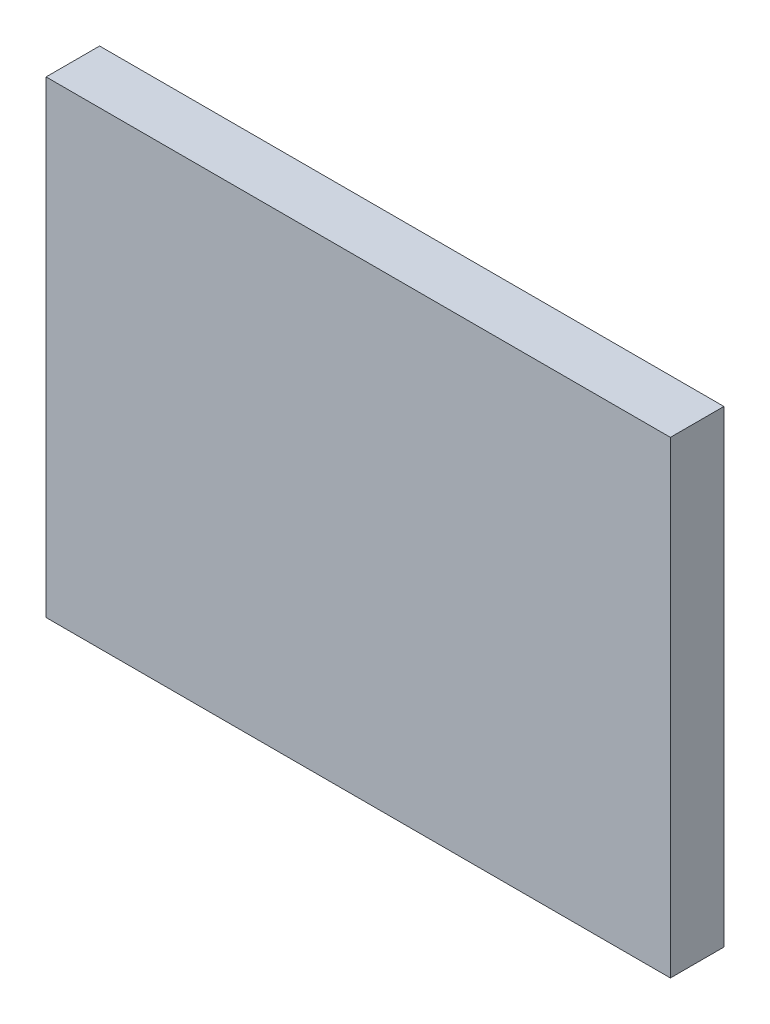
ISO-10303-21;
HEADER;
FILE_DESCRIPTION(('STEP AP214'),'2;1');
FILE_NAME('part.step','',(''),(''),'','','');
FILE_SCHEMA(('AUTOMOTIVE_DESIGN { 1 0 10303 214 1 1 1 1 }'));
ENDSEC;
DATA;
#1=APPLICATION_CONTEXT('core data for automotive mechanical design processes');
#2=APPLICATION_PROTOCOL_DEFINITION('international standard','automotive_design',2000,#1);
#3=PRODUCT_CONTEXT('',#1,'mechanical');
#4=PRODUCT('Part','Part','',(#3));
#5=PRODUCT_RELATED_PRODUCT_CATEGORY('part','',(#4));
#6=PRODUCT_DEFINITION_FORMATION('','',#4);
#7=PRODUCT_DEFINITION_CONTEXT('part definition',#1,'design');
#8=PRODUCT_DEFINITION('design','',#6,#7);
#9=PRODUCT_DEFINITION_SHAPE('','',#8);
#10=(LENGTH_UNIT() NAMED_UNIT(*) SI_UNIT(.MILLI.,.METRE.));
#11=(NAMED_UNIT(*) PLANE_ANGLE_UNIT() SI_UNIT($,.RADIAN.));
#12=(NAMED_UNIT(*) SI_UNIT($,.STERADIAN.) SOLID_ANGLE_UNIT());
#13=UNCERTAINTY_MEASURE_WITH_UNIT(LENGTH_MEASURE(1.E-05),#10,'distance_accuracy_value','');
#14=(GEOMETRIC_REPRESENTATION_CONTEXT(3) GLOBAL_UNCERTAINTY_ASSIGNED_CONTEXT((#13)) GLOBAL_UNIT_ASSIGNED_CONTEXT((#10,
#11,#12)) REPRESENTATION_CONTEXT('',''));
#15=CARTESIAN_POINT('',(0.,0.,0.));
#16=DIRECTION('',(0.,0.,1.));
#17=DIRECTION('',(1.,0.,0.));
#18=AXIS2_PLACEMENT_3D('',#15,#16,#17);
#19=CARTESIAN_POINT('',(3.763333333,7.955,0.76487));
#20=DIRECTION('',(0.,0.,-1.));
#21=DIRECTION('',(0.,1.,0.));
#22=AXIS2_PLACEMENT_3D('',#19,#20,#21);
#23=PLANE('',#22);
#24=DIRECTION('',(1.,0.,0.));
#25=VECTOR('',#24,1.);
#26=CARTESIAN_POINT('',(3.563333333,8.105,0.76487));
#27=LINE('',#26,#25);
#28=CARTESIAN_POINT('',(3.563333333,8.105,0.76487));
#29=VERTEX_POINT('',#28);
#30=CARTESIAN_POINT('',(3.963333333,8.105,0.76487));
#31=VERTEX_POINT('',#30);
#32=EDGE_CURVE('E55',#29,#31,#27,.T.);
#33=ORIENTED_EDGE('',*,*,#32,.T.);
#34=DIRECTION('',(0.,1.,0.));
#35=VECTOR('',#34,1.);
#36=CARTESIAN_POINT('',(3.963333333,8.105,0.76487));
#37=LINE('',#36,#35);
#38=CARTESIAN_POINT('',(3.963333333,7.805,0.76487));
#39=VERTEX_POINT('',#38);
#40=EDGE_CURVE('E57',#31,#39,#37,.F.);
#41=ORIENTED_EDGE('',*,*,#40,.T.);
#42=DIRECTION('',(1.,0.,0.));
#43=VECTOR('',#42,1.);
#44=CARTESIAN_POINT('',(3.963333333,7.805,0.76487));
#45=LINE('',#44,#43);
#46=CARTESIAN_POINT('',(3.563333333,7.805,0.76487));
#47=VERTEX_POINT('',#46);
#48=EDGE_CURVE('E20',#39,#47,#45,.F.);
#49=ORIENTED_EDGE('',*,*,#48,.T.);
#50=DIRECTION('',(0.,1.,0.));
#51=VECTOR('',#50,1.);
#52=CARTESIAN_POINT('',(3.563333333,7.805,0.76487));
#53=LINE('',#52,#51);
#54=EDGE_CURVE('E80',#47,#29,#53,.T.);
#55=ORIENTED_EDGE('',*,*,#54,.T.);
#56=EDGE_LOOP('',(#33,#41,#49,#55));
#57=FACE_BOUND('',#56,.T.);
#58=ADVANCED_FACE('F17',(#57),#23,.T.);
#59=CARTESIAN_POINT('',(3.963333333,7.805,0.76487));
#60=DIRECTION('',(0.,1.,0.));
#61=DIRECTION('',(0.,0.,1.));
#62=AXIS2_PLACEMENT_3D('',#59,#60,#61);
#63=PLANE('',#62);
#64=DIRECTION('',(0.,0.,-1.));
#65=VECTOR('',#64,1.);
#66=CARTESIAN_POINT('',(3.563333333,7.805,0.76487));
#67=LINE('',#66,#65);
#68=CARTESIAN_POINT('',(3.563333333,7.805,0.79916));
#69=VERTEX_POINT('',#68);
#70=EDGE_CURVE('E68',#69,#47,#67,.T.);
#71=ORIENTED_EDGE('',*,*,#70,.T.);
#72=ORIENTED_EDGE('',*,*,#48,.F.);
#73=DIRECTION('',(0.,0.,1.));
#74=VECTOR('',#73,1.);
#75=CARTESIAN_POINT('',(3.963333333,7.805,0.76487));
#76=LINE('',#75,#74);
#77=CARTESIAN_POINT('',(3.963333333,7.805,0.79916));
#78=VERTEX_POINT('',#77);
#79=EDGE_CURVE('E63',#39,#78,#76,.T.);
#80=ORIENTED_EDGE('',*,*,#79,.T.);
#81=DIRECTION('',(1.,0.,0.));
#82=VECTOR('',#81,1.);
#83=CARTESIAN_POINT('',(3.763333333,7.805,0.79916));
#84=LINE('',#83,#82);
#85=EDGE_CURVE('E83',#69,#78,#84,.T.);
#86=ORIENTED_EDGE('',*,*,#85,.F.);
#87=EDGE_LOOP('',(#71,#72,#80,#86));
#88=FACE_BOUND('',#87,.T.);
#89=ADVANCED_FACE('F65',(#88),#63,.F.);
#90=CARTESIAN_POINT('',(3.963333333,8.105,0.76487));
#91=DIRECTION('',(-1.,0.,0.));
#92=DIRECTION('',(0.,0.,1.));
#93=AXIS2_PLACEMENT_3D('',#90,#91,#92);
#94=PLANE('',#93);
#95=ORIENTED_EDGE('',*,*,#79,.F.);
#96=ORIENTED_EDGE('',*,*,#40,.F.);
#97=DIRECTION('',(0.,0.,-1.));
#98=VECTOR('',#97,1.);
#99=CARTESIAN_POINT('',(3.963333333,8.105,0.76487));
#100=LINE('',#99,#98);
#101=CARTESIAN_POINT('',(3.963333333,8.105,0.79916));
#102=VERTEX_POINT('',#101);
#103=EDGE_CURVE('E75',#31,#102,#100,.F.);
#104=ORIENTED_EDGE('',*,*,#103,.T.);
#105=DIRECTION('',(0.,-1.,0.));
#106=VECTOR('',#105,1.);
#107=CARTESIAN_POINT('',(3.963333333,7.955,0.79916));
#108=LINE('',#107,#106);
#109=EDGE_CURVE('E72',#78,#102,#108,.F.);
#110=ORIENTED_EDGE('',*,*,#109,.F.);
#111=EDGE_LOOP('',(#95,#96,#104,#110));
#112=FACE_BOUND('',#111,.T.);
#113=ADVANCED_FACE('F70',(#112),#94,.F.);
#114=CARTESIAN_POINT('',(3.563333333,8.105,0.76487));
#115=DIRECTION('',(0.,-1.,0.));
#116=DIRECTION('',(0.,0.,-1.));
#117=AXIS2_PLACEMENT_3D('',#114,#115,#116);
#118=PLANE('',#117);
#119=ORIENTED_EDGE('',*,*,#103,.F.);
#120=ORIENTED_EDGE('',*,*,#32,.F.);
#121=DIRECTION('',(0.,0.,-1.));
#122=VECTOR('',#121,1.);
#123=CARTESIAN_POINT('',(3.563333333,8.105,0.76487));
#124=LINE('',#123,#122);
#125=CARTESIAN_POINT('',(3.563333333,8.105,0.79916));
#126=VERTEX_POINT('',#125);
#127=EDGE_CURVE('E35',#29,#126,#124,.F.);
#128=ORIENTED_EDGE('',*,*,#127,.T.);
#129=DIRECTION('',(1.,0.,0.));
#130=VECTOR('',#129,1.);
#131=CARTESIAN_POINT('',(3.763333333,8.105,0.79916));
#132=LINE('',#131,#130);
#133=EDGE_CURVE('E26',#102,#126,#132,.F.);
#134=ORIENTED_EDGE('',*,*,#133,.F.);
#135=EDGE_LOOP('',(#119,#120,#128,#134));
#136=FACE_BOUND('',#135,.T.);
#137=ADVANCED_FACE('F89',(#136),#118,.F.);
#138=CARTESIAN_POINT('',(3.563333333,7.805,0.76487));
#139=DIRECTION('',(1.,0.,0.));
#140=DIRECTION('',(0.,0.,-1.));
#141=AXIS2_PLACEMENT_3D('',#138,#139,#140);
#142=PLANE('',#141);
#143=ORIENTED_EDGE('',*,*,#127,.F.);
#144=ORIENTED_EDGE('',*,*,#54,.F.);
#145=ORIENTED_EDGE('',*,*,#70,.F.);
#146=DIRECTION('',(0.,-1.,0.));
#147=VECTOR('',#146,1.);
#148=CARTESIAN_POINT('',(3.563333333,7.955,0.79916));
#149=LINE('',#148,#147);
#150=EDGE_CURVE('E11',#126,#69,#149,.T.);
#151=ORIENTED_EDGE('',*,*,#150,.F.);
#152=EDGE_LOOP('',(#143,#144,#145,#151));
#153=FACE_BOUND('',#152,.T.);
#154=ADVANCED_FACE('F91',(#153),#142,.F.);
#155=CARTESIAN_POINT('',(3.763333333,7.955,0.79916));
#156=DIRECTION('',(0.,0.,1.));
#157=DIRECTION('',(0.,-1.,0.));
#158=AXIS2_PLACEMENT_3D('',#155,#156,#157);
#159=PLANE('',#158);
#160=ORIENTED_EDGE('',*,*,#133,.T.);
#161=ORIENTED_EDGE('',*,*,#150,.T.);
#162=ORIENTED_EDGE('',*,*,#85,.T.);
#163=ORIENTED_EDGE('',*,*,#109,.T.);
#164=EDGE_LOOP('',(#160,#161,#162,#163));
#165=FACE_BOUND('',#164,.T.);
#166=ADVANCED_FACE('F88',(#165),#159,.T.);
#167=CLOSED_SHELL('',(#58,#89,#113,#137,#154,#166));
#168=MANIFOLD_SOLID_BREP('B1',#167);
#169=ADVANCED_BREP_SHAPE_REPRESENTATION('',(#18,#168),#14);
#170=SHAPE_DEFINITION_REPRESENTATION(#9,#169);
ENDSEC;
END-ISO-10303-21;
